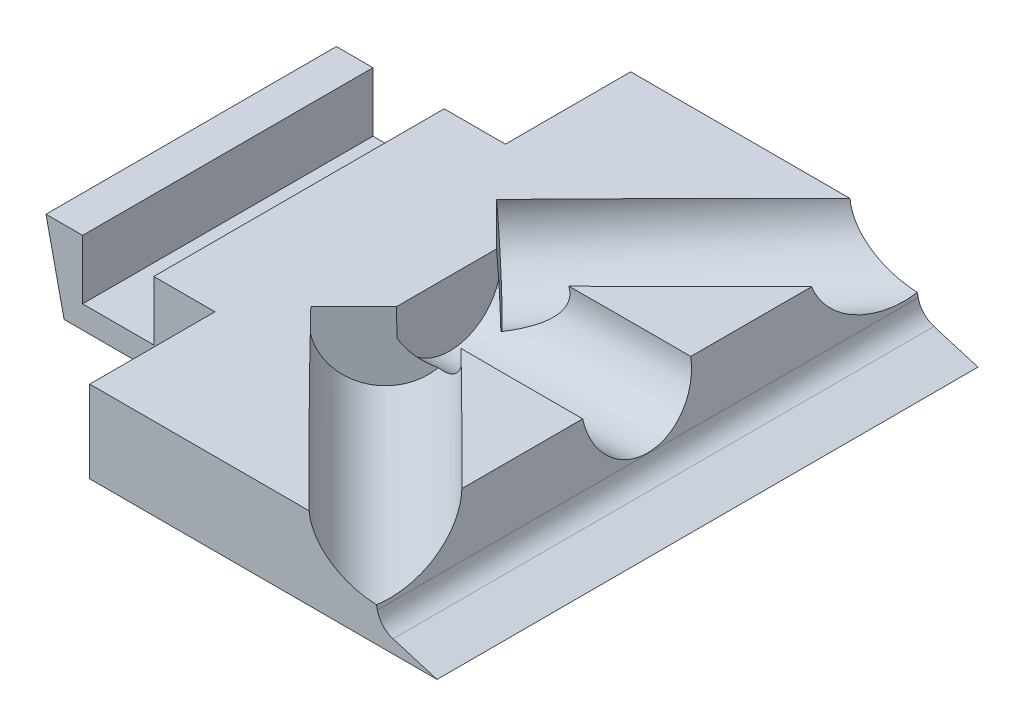
ISO-10303-21;
HEADER;
FILE_DESCRIPTION(('STEP AP214'),'2;1');
FILE_NAME('part.step','',(''),(''),'','','');
FILE_SCHEMA(('AUTOMOTIVE_DESIGN { 1 0 10303 214 1 1 1 1 }'));
ENDSEC;
DATA;
#1=APPLICATION_CONTEXT('core data for automotive mechanical design processes');
#2=APPLICATION_PROTOCOL_DEFINITION('international standard','automotive_design',2000,#1);
#3=PRODUCT_CONTEXT('',#1,'mechanical');
#4=PRODUCT('Part','Part','',(#3));
#5=PRODUCT_RELATED_PRODUCT_CATEGORY('part','',(#4));
#6=PRODUCT_DEFINITION_FORMATION('','',#4);
#7=PRODUCT_DEFINITION_CONTEXT('part definition',#1,'design');
#8=PRODUCT_DEFINITION('design','',#6,#7);
#9=PRODUCT_DEFINITION_SHAPE('','',#8);
#10=(LENGTH_UNIT() NAMED_UNIT(*) SI_UNIT(.MILLI.,.METRE.));
#11=(NAMED_UNIT(*) PLANE_ANGLE_UNIT() SI_UNIT($,.RADIAN.));
#12=(NAMED_UNIT(*) SI_UNIT($,.STERADIAN.) SOLID_ANGLE_UNIT());
#13=UNCERTAINTY_MEASURE_WITH_UNIT(LENGTH_MEASURE(1.E-05),#10,'distance_accuracy_value','');
#14=(GEOMETRIC_REPRESENTATION_CONTEXT(3) GLOBAL_UNCERTAINTY_ASSIGNED_CONTEXT((#13)) GLOBAL_UNIT_ASSIGNED_CONTEXT((#10,
#11,#12)) REPRESENTATION_CONTEXT('',''));
#15=CARTESIAN_POINT('',(0.,0.,0.));
#16=DIRECTION('',(0.,0.,1.));
#17=DIRECTION('',(1.,0.,0.));
#18=AXIS2_PLACEMENT_3D('',#15,#16,#17);
#19=CARTESIAN_POINT('',(29.0534494855228,3.,-54.5438018836308));
#20=DIRECTION('',(-0.978105928984835,-0.208107644464859,0.));
#21=DIRECTION('',(0.208107644464859,-0.978105928984836,0.));
#22=AXIS2_PLACEMENT_3D('',#19,#20,#21);
#23=PLANE('',#22);
#24=CARTESIAN_POINT('',(26.4460534707917,15.2547612692362,-45.9972058727721));
#25=DIRECTION('',(-0.978105928984835,-0.208107644464859,0.));
#26=DIRECTION('',(-0.0258354710819737,0.121426714085276,0.992264118841564));
#27=AXIS2_PLACEMENT_3D('',#24,#25,#26);
#28=ELLIPSE('',#27,13.5164397497986,9.49999999999975);
#29=CARTESIAN_POINT('',(26.6241432993672,14.4177390749316,-32.7461821799542));
#30=VERTEX_POINT('',#29);
#31=CARTESIAN_POINT('',(28.4070974389529,6.03785461887894,-49.5438018836307));
#32=VERTEX_POINT('',#31);
#33=EDGE_CURVE('E218',#30,#32,#28,.F.);
#34=ORIENTED_EDGE('',*,*,#33,.F.);
#35=DIRECTION('',(0.,0.,1.));
#36=VECTOR('',#35,1.);
#37=CARTESIAN_POINT('',(26.6241432993672,14.4177390749316,-54.5438018836308));
#38=LINE('',#37,#36);
#39=CARTESIAN_POINT('',(26.6241432993672,14.4177390749316,-11.5339275404717));
#40=VERTEX_POINT('',#39);
#41=EDGE_CURVE('E48',#30,#40,#38,.T.);
#42=ORIENTED_EDGE('',*,*,#41,.T.);
#43=CARTESIAN_POINT('',(26.5329230763294,14.8464741232089,-2.04380188363075));
#44=DIRECTION('',(-0.978105928984835,-0.208107644464859,0.));
#45=DIRECTION('',(-0.208107644464859,0.978105928984836,0.));
#46=AXIS2_PLACEMENT_3D('',#43,#44,#45);
#47=ELLIPSE('',#46,9.61631485144088,9.5);
#48=CARTESIAN_POINT('',(26.6241432993672,14.4177390749316,7.44632377321017));
#49=VERTEX_POINT('',#48);
#50=EDGE_CURVE('E223',#49,#40,#47,.F.);
#51=ORIENTED_EDGE('',*,*,#50,.F.);
#52=CARTESIAN_POINT('',(26.6241432993672,14.4177390749316,28.6585784126926));
#53=VERTEX_POINT('',#52);
#54=EDGE_CURVE('E359',#49,#53,#38,.T.);
#55=ORIENTED_EDGE('',*,*,#54,.T.);
#56=CARTESIAN_POINT('',(26.4460534707917,15.2547612692361,41.9096021055104));
#57=DIRECTION('',(-0.978105928984835,-0.208107644464859,0.));
#58=DIRECTION('',(-0.0258354710819744,0.12142671408528,-0.992264118841563));
#59=AXIS2_PLACEMENT_3D('',#56,#57,#58);
#60=ELLIPSE('',#59,13.5164397497986,9.49999999999983);
#61=CARTESIAN_POINT('',(28.4070974389529,6.03785461887886,45.4561981163693));
#62=VERTEX_POINT('',#61);
#63=EDGE_CURVE('E220',#62,#53,#60,.F.);
#64=ORIENTED_EDGE('',*,*,#63,.F.);
#65=DIRECTION('',(0.208107644464859,-0.978105928984835,0.));
#66=VECTOR('',#65,1.);
#67=CARTESIAN_POINT('',(29.0534494855228,3.,45.4561981163693));
#68=LINE('',#67,#66);
#69=CARTESIAN_POINT('',(28.5602756421312,5.31791706394046,45.4561981163693));
#70=VERTEX_POINT('',#69);
#71=EDGE_CURVE('E226',#62,#70,#68,.T.);
#72=ORIENTED_EDGE('',*,*,#71,.T.);
#73=DIRECTION('',(0.,0.,1.));
#74=VECTOR('',#73,1.);
#75=CARTESIAN_POINT('',(28.5602756421312,5.31791706394046,-49.5438018836307));
#76=LINE('',#75,#74);
#77=CARTESIAN_POINT('',(28.5602756421313,5.31791706394044,-49.5438018836307));
#78=VERTEX_POINT('',#77);
#79=EDGE_CURVE('E302',#70,#78,#76,.F.);
#80=ORIENTED_EDGE('',*,*,#79,.T.);
#81=DIRECTION('',(0.208107644464859,-0.978105928984836,0.));
#82=VECTOR('',#81,1.);
#83=CARTESIAN_POINT('',(15.8052901091694,65.266349068861,-49.5438018836307));
#84=LINE('',#83,#82);
#85=EDGE_CURVE('E232',#32,#78,#84,.T.);
#86=ORIENTED_EDGE('',*,*,#85,.F.);
#87=EDGE_LOOP('',(#34,#42,#51,#55,#64,#72,#80,#86));
#88=FACE_BOUND('',#87,.T.);
#89=ADVANCED_FACE('F33',(#88),#23,.F.);
#90=CARTESIAN_POINT('',(-55.9465505144772,50.,-49.5438018836307));
#91=DIRECTION('',(0.,0.,1.));
#92=DIRECTION('',(1.,0.,0.));
#93=AXIS2_PLACEMENT_3D('',#90,#91,#92);
#94=PLANE('',#93);
#95=DIRECTION('',(0.,-1.,0.));
#96=VECTOR('',#95,1.);
#97=CARTESIAN_POINT('',(-21.9465505144772,0.,-49.5438018836307));
#98=LINE('',#97,#96);
#99=CARTESIAN_POINT('',(-21.9465505144772,14.4177390749316,-49.5438018836307));
#100=VERTEX_POINT('',#99);
#101=CARTESIAN_POINT('',(-21.9465505144772,0.,-49.5438018836307));
#102=VERTEX_POINT('',#101);
#103=EDGE_CURVE('E337',#100,#102,#98,.T.);
#104=ORIENTED_EDGE('',*,*,#103,.F.);
#105=DIRECTION('',(1.,0.,0.));
#106=VECTOR('',#105,1.);
#107=CARTESIAN_POINT('',(-55.9465505144772,14.4177390749316,-49.5438018836307));
#108=LINE('',#107,#106);
#109=CARTESIAN_POINT('',(16.5816523108521,14.4177390749316,-49.5438018836307));
#110=VERTEX_POINT('',#109);
#111=EDGE_CURVE('E192',#100,#110,#108,.T.);
#112=ORIENTED_EDGE('',*,*,#111,.T.);
#113=CARTESIAN_POINT('',(29.9926494816504,15.555699919965,-49.5438018836307));
#114=DIRECTION('',(0.,0.,1.));
#115=DIRECTION('',(-0.996419324090102,-0.0845489833163317,0.));
#116=AXIS2_PLACEMENT_3D('',#113,#114,#115);
#117=ELLIPSE('',#116,13.4591901688025,9.49999999999975);
#118=EDGE_CURVE('E296',#32,#110,#117,.F.);
#119=ORIENTED_EDGE('',*,*,#118,.F.);
#120=ORIENTED_EDGE('',*,*,#85,.T.);
#121=CARTESIAN_POINT('',(32.4726993580706,6.1503476417999,-49.5438018836307));
#122=DIRECTION('',(0.,0.,1.));
#123=DIRECTION('',(1.,0.,0.));
#124=AXIS2_PLACEMENT_3D('',#121,#122,#123);
#125=CIRCLE('',#124,4.);
#126=CARTESIAN_POINT('',(31.3233078158052,2.31904250091529,-49.5438018836307));
#127=VERTEX_POINT('',#126);
#128=EDGE_CURVE('E306',#78,#127,#125,.T.);
#129=ORIENTED_EDGE('',*,*,#128,.T.);
#130=DIRECTION('',(0.957826285221151,-0.287347885566345,0.));
#131=VECTOR('',#130,1.);
#132=CARTESIAN_POINT('',(-61.8639817071377,30.2752293577982,-49.5438018836307));
#133=LINE('',#132,#131);
#134=CARTESIAN_POINT('',(39.0534494855228,0.,-49.5438018836307));
#135=VERTEX_POINT('',#134);
#136=EDGE_CURVE('E235',#127,#135,#133,.T.);
#137=ORIENTED_EDGE('',*,*,#136,.T.);
#138=DIRECTION('',(-1.,0.,0.));
#139=VECTOR('',#138,1.);
#140=CARTESIAN_POINT('',(-55.9465505144772,0.,-49.5438018836307));
#141=LINE('',#140,#139);
#142=EDGE_CURVE('E287',#135,#102,#141,.T.);
#143=ORIENTED_EDGE('',*,*,#142,.T.);
#144=EDGE_LOOP('',(#104,#112,#119,#120,#129,#137,#143));
#145=FACE_BOUND('',#144,.T.);
#146=ADVANCED_FACE('F439',(#145),#94,.F.);
#147=CARTESIAN_POINT('',(-55.9465505144772,50.,45.4561981163693));
#148=DIRECTION('',(0.,0.,-1.));
#149=DIRECTION('',(-1.,0.,0.));
#150=AXIS2_PLACEMENT_3D('',#147,#148,#149);
#151=PLANE('',#150);
#152=CARTESIAN_POINT('',(29.9926494816506,15.555699919965,45.4561981163693));
#153=DIRECTION('',(0.,0.,-1.));
#154=DIRECTION('',(-0.996419324090102,-0.0845489833163307,0.));
#155=AXIS2_PLACEMENT_3D('',#152,#153,#154);
#156=ELLIPSE('',#155,13.4591901688027,9.49999999999983);
#157=CARTESIAN_POINT('',(16.5816523108518,14.4177390749316,45.4561981163693));
#158=VERTEX_POINT('',#157);
#159=EDGE_CURVE('E201',#158,#62,#156,.F.);
#160=ORIENTED_EDGE('',*,*,#159,.F.);
#161=DIRECTION('',(1.,0.,0.));
#162=VECTOR('',#161,1.);
#163=CARTESIAN_POINT('',(16.5816523108521,14.4177390749316,45.4561981163693));
#164=LINE('',#163,#162);
#165=CARTESIAN_POINT('',(-21.9465505144772,14.4177390749316,45.4561981163693));
#166=VERTEX_POINT('',#165);
#167=EDGE_CURVE('E184',#166,#158,#164,.T.);
#168=ORIENTED_EDGE('',*,*,#167,.F.);
#169=DIRECTION('',(0.,1.,0.));
#170=VECTOR('',#169,1.);
#171=CARTESIAN_POINT('',(-21.9465505144772,0.,45.4561981163693));
#172=LINE('',#171,#170);
#173=CARTESIAN_POINT('',(-21.9465505144772,0.,45.4561981163693));
#174=VERTEX_POINT('',#173);
#175=EDGE_CURVE('E198',#174,#166,#172,.T.);
#176=ORIENTED_EDGE('',*,*,#175,.F.);
#177=DIRECTION('',(1.,0.,0.));
#178=VECTOR('',#177,1.);
#179=CARTESIAN_POINT('',(-55.9465505144772,0.,45.4561981163693));
#180=LINE('',#179,#178);
#181=CARTESIAN_POINT('',(39.0534494855228,0.,45.4561981163693));
#182=VERTEX_POINT('',#181);
#183=EDGE_CURVE('E282',#174,#182,#180,.T.);
#184=ORIENTED_EDGE('',*,*,#183,.T.);
#185=DIRECTION('',(0.957826285221151,-0.287347885566345,0.));
#186=VECTOR('',#185,1.);
#187=CARTESIAN_POINT('',(39.0534494855228,0.,45.4561981163693));
#188=LINE('',#187,#186);
#189=CARTESIAN_POINT('',(31.3233078158052,2.31904250091529,45.4561981163693));
#190=VERTEX_POINT('',#189);
#191=EDGE_CURVE('E229',#190,#182,#188,.T.);
#192=ORIENTED_EDGE('',*,*,#191,.F.);
#193=CARTESIAN_POINT('',(32.4726993580706,6.1503476417999,45.4561981163693));
#194=DIRECTION('',(0.,0.,-1.));
#195=DIRECTION('',(-1.,0.,0.));
#196=AXIS2_PLACEMENT_3D('',#193,#194,#195);
#197=CIRCLE('',#196,4.);
#198=EDGE_CURVE('E304',#190,#70,#197,.T.);
#199=ORIENTED_EDGE('',*,*,#198,.T.);
#200=ORIENTED_EDGE('',*,*,#71,.F.);
#201=EDGE_LOOP('',(#160,#168,#176,#184,#192,#199,#200));
#202=FACE_BOUND('',#201,.T.);
#203=ADVANCED_FACE('F197',(#202),#151,.F.);
#204=CARTESIAN_POINT('',(-6.71686597218381,13.0509855145892,-2.04380188363075));
#205=DIRECTION('',(0.998545180917308,0.0539214397695347,0.));
#206=DIRECTION('',(-0.0539214397695347,0.998545180917309,0.));
#207=AXIS2_PLACEMENT_3D('',#204,#205,#206);
#208=CYLINDRICAL_SURFACE('',#207,9.5);
#209=ORIENTED_EDGE('',*,*,#50,.T.);
#210=CARTESIAN_POINT('',(18.5933851452674,14.4177390749316,-2.04380188363075));
#211=DIRECTION('',(0.,-1.,0.));
#212=DIRECTION('',(1.,0.,0.));
#213=AXIS2_PLACEMENT_3D('',#210,#211,#212);
#214=ELLIPSE('',#213,176.182239209559,9.5);
#215=CARTESIAN_POINT('',(5.22643161729281,14.4177390749316,-11.5164201736081));
#216=VERTEX_POINT('',#215);
#217=EDGE_CURVE('E365',#40,#216,#214,.F.);
#218=ORIENTED_EDGE('',*,*,#217,.T.);
#219=CARTESIAN_POINT('',(-4.56689805842484,20.5014142819925,-8.0947521144356));
#220=CARTESIAN_POINT('',(-4.33225599602943,20.4488003755294,-8.17364472122514));
#221=CARTESIAN_POINT('',(-4.09831991987234,20.3936533999042,-8.25297274054923));
#222=CARTESIAN_POINT('',(-3.6319723273335,20.2779532455273,-8.41225867708304));
#223=CARTESIAN_POINT('',(-3.39956099855203,20.2173994144437,-8.49221666923444));
#224=CARTESIAN_POINT('',(-2.935850455229,20.0903986941744,-8.65270379654423));
#225=CARTESIAN_POINT('',(-2.70455550191642,20.0239373811584,-8.73323386194536));
#226=CARTESIAN_POINT('',(-2.24388052249788,19.8848391065148,-8.89442045986951));
#227=CARTESIAN_POINT('',(-2.01450042627539,19.8122023721123,-8.97507698763224));
#228=CARTESIAN_POINT('',(-1.55665311912561,19.6598445083659,-9.13671461530698));
#229=CARTESIAN_POINT('',(-1.32819788787797,19.5800865754283,-9.21769505721916));
#230=CARTESIAN_POINT('',(-0.873840453641928,19.4132426691012,-9.37926210189281));
#231=CARTESIAN_POINT('',(-0.647938153388363,19.3261569759698,-9.45984871959191));
#232=CARTESIAN_POINT('',(-0.199351831332736,19.144036344205,-9.6202507628795));
#233=CARTESIAN_POINT('',(0.023335063029552,19.0490090914755,-9.70006685259626));
#234=CARTESIAN_POINT('',(0.465080976334485,18.850102721621,-9.85864143280677));
#235=CARTESIAN_POINT('',(0.684140511012849,18.746224876001,-9.93740007334148));
#236=CARTESIAN_POINT('',(1.0882753148595,18.5434306951372,-10.0827938815438));
#237=CARTESIAN_POINT('',(1.27391125425415,18.4457695180671,-10.1496176838629));
#238=CARTESIAN_POINT('',(1.64121856569114,18.2422888667174,-10.2818141032291));
#239=CARTESIAN_POINT('',(1.8228897567433,18.1364690209913,-10.3471866540291));
#240=CARTESIAN_POINT('',(2.18180318740148,17.9154812272708,-10.4761990874294));
#241=CARTESIAN_POINT('',(2.35903321530376,17.8002905639837,-10.5398342282835));
#242=CARTESIAN_POINT('',(2.70736810734731,17.5597145325413,-10.6646267749547));
#243=CARTESIAN_POINT('',(2.87847325864263,17.4343296432282,-10.7257842969483));
#244=CARTESIAN_POINT('',(3.21560789538356,17.1700108716297,-10.8458280804137));
#245=CARTESIAN_POINT('',(3.3815120071856,17.0308919788594,-10.9046622011023));
#246=CARTESIAN_POINT('',(3.70301721095151,16.7393269509347,-11.0179659926317));
#247=CARTESIAN_POINT('',(3.85861388019386,16.5868751591608,-11.0724337920489));
#248=CARTESIAN_POINT('',(4.15532843354882,16.2681178542739,-11.175255156819));
#249=CARTESIAN_POINT('',(4.29652253014544,16.1018947160832,-11.2236412584394));
#250=CARTESIAN_POINT('',(4.56092453322871,15.7538739756097,-11.312729991647));
#251=CARTESIAN_POINT('',(4.6841501476811,15.5720919909097,-11.3534401995967));
#252=CARTESIAN_POINT('',(4.90699547178048,15.1928383248048,-11.4248090153655));
#253=CARTESIAN_POINT('',(5.00664714506123,14.9953883784836,-11.4554812554512));
#254=CARTESIAN_POINT('',(5.17599854601488,14.5865103891999,-11.504156845132));
#255=CARTESIAN_POINT('',(5.24572689940183,14.3750959296611,-11.5221723132073));
#256=CARTESIAN_POINT('',(5.34995577599859,13.9412413877521,-11.543365030161));
#257=CARTESIAN_POINT('',(5.38420212979633,13.71873356199,-11.5464357958064));
#258=CARTESIAN_POINT('',(5.41393294135975,13.2714775021975,-11.5365326069259));
#259=CARTESIAN_POINT('',(5.4094138866725,13.0467290669929,-11.5235571985806));
#260=CARTESIAN_POINT('',(5.3655597958662,12.6205480738891,-11.4842653281633));
#261=CARTESIAN_POINT('',(5.32906057848457,12.4186964095706,-11.4591085752597));
#262=CARTESIAN_POINT('',(5.22927541660934,12.0235933932393,-11.3979350687655));
#263=CARTESIAN_POINT('',(5.16597845962318,11.830345613103,-11.3619138521912));
#264=CARTESIAN_POINT('',(4.97172264577934,11.3387911087939,-11.2561248609913));
#265=CARTESIAN_POINT('',(4.82309423269255,11.0489905434561,-11.1792291698687));
#266=CARTESIAN_POINT('',(4.5709731233482,10.6363754584025,-11.0521685963663));
#267=CARTESIAN_POINT('',(4.48187362643259,10.5022858197283,-11.0077672229066));
#268=CARTESIAN_POINT('',(4.29553006882358,10.2410530940272,-10.9156780870717));
#269=CARTESIAN_POINT('',(4.19828744896855,10.1139087846493,-10.8679909063485));
#270=CARTESIAN_POINT('',(3.91295820390433,9.76255830121186,-10.7288676210697));
#271=CARTESIAN_POINT('',(3.71691217857024,9.54610723217295,-10.6341976878373));
#272=CARTESIAN_POINT('',(3.30856784086871,9.13237785709488,-10.4381006952109));
#273=CARTESIAN_POINT('',(3.09625481624534,8.93511728218306,-10.3366675300084));
#274=CARTESIAN_POINT('',(2.65870269186332,8.55646590935589,-10.1281800605755));
#275=CARTESIAN_POINT('',(2.43340888811384,8.37515186222596,-10.021102157976));
#276=CARTESIAN_POINT('',(1.97367945489025,8.02718286624318,-9.80277028206226));
#277=CARTESIAN_POINT('',(1.73924105454741,7.86053241113764,-9.69151504337773));
#278=CARTESIAN_POINT('',(1.16336505936575,7.47279453375139,-9.41805676499994));
#279=CARTESIAN_POINT('',(0.818360817173119,7.25825792323411,-9.25408961908723));
#280=CARTESIAN_POINT('',(0.118215035644663,6.8511184717841,-8.92028491578519));
#281=CARTESIAN_POINT('',(-0.236932595157035,6.658529172737,-8.7504438173944));
#282=CARTESIAN_POINT('',(-0.946922814297158,6.29630927652942,-8.40912523956741));
#283=CARTESIAN_POINT('',(-1.30161631569162,6.12628262905609,-8.23775634720461));
#284=CARTESIAN_POINT('',(-1.83709095063916,5.88358396276574,-7.97715602075883));
#285=CARTESIAN_POINT('',(-2.01602683832496,5.8047927816907,-7.88976128493358));
#286=CARTESIAN_POINT('',(-2.37492982051103,5.65107606405432,-7.71372460314205));
#287=CARTESIAN_POINT('',(-2.55489685977932,5.57615032255826,-7.6250827236136));
#288=CARTESIAN_POINT('',(-2.73529182406675,5.50305391920793,-7.53579895838253));
#289=B_SPLINE_CURVE_WITH_KNOTS('',3,(#219,#220,#221,#222,#223,#224,#225,#226,#227,#228,#229,
#230,#231,#232,#233,#234,#235,#236,#237,#238,#239,#240,#241,#242,#243,#244,#245,#246,#247,#248,
#249,#250,#251,#252,#253,#254,#255,#256,#257,#258,#259,#260,#261,#262,#263,#264,#265,#266,#267,
#268,#269,#270,#271,#272,#273,#274,#275,#276,#277,#278,#279,#280,#281,#282,#283,#284,#285,#286,
#287,#288),.UNSPECIFIED.,.F.,.F.,(4,2,2,2,2,2,2,2,2,2,2,2,2,2,2,2,2,2,2,2,2,2,2,2,2,2,2,2,2,2,2,
2,2,2,4),(0.,0.759235565759512,1.51856285664431,2.27979792708037,3.04100499993291,
3.80640315451802,4.57177204890092,5.33640860609208,6.10093549774817,6.76120496214763,
7.42150450496608,8.08345527666092,8.74537497320384,9.41790796150104,10.0907276759899,
10.7597790295933,11.4281665100883,12.0956424697516,12.7624784669635,13.434058883109,
14.1057001504001,14.7232015907741,15.3409570391736,16.338754396032,16.8395483653825,
17.340253911079,18.2597146907051,19.1800170979018,20.1045308137893,21.0293268728913,
22.3427231125527,23.6569254030598,24.9436310287062,25.5860736801143,26.2284822359456),.UNSPECIFIED.);
#290=CARTESIAN_POINT('',(-2.73529182406738,5.50305391920772,-7.53579895838272));
#291=VERTEX_POINT('',#290);
#292=EDGE_CURVE('E271',#216,#291,#289,.T.);
#293=ORIENTED_EDGE('',*,*,#292,.T.);
#294=CARTESIAN_POINT('',(2.07595286425553,13.525797731757,-2.04380188363075));
#295=DIRECTION('',(0.705837415242118,0.0598922907279468,-0.705837415242125));
#296=DIRECTION('',(0.706320591921486,0.0163066443508857,0.707704256577347));
#297=AXIS2_PLACEMENT_3D('',#294,#295,#296);
#298=ELLIPSE('',#297,13.4173205237939,9.5);
#299=CARTESIAN_POINT('',(-6.5425041256802,9.82206243118891,-10.9765312351766));
#300=VERTEX_POINT('',#299);
#301=EDGE_CURVE('E276',#300,#291,#298,.F.);
#302=ORIENTED_EDGE('',*,*,#301,.F.);
#303=CARTESIAN_POINT('',(-6.71686597218381,13.0509855145892,-2.04380188363075));
#304=DIRECTION('',(0.998545180917308,0.0539214397695347,0.));
#305=DIRECTION('',(-0.0539214397695347,0.998545180917309,0.));
#306=AXIS2_PLACEMENT_3D('',#303,#304,#305);
#307=CIRCLE('',#306,9.5);
#308=CARTESIAN_POINT('',(-6.54250412568018,9.82206243118863,6.88892746791498));
#309=VERTEX_POINT('',#308);
#310=EDGE_CURVE('E280',#309,#300,#307,.T.);
#311=ORIENTED_EDGE('',*,*,#310,.F.);
#312=CARTESIAN_POINT('',(2.07595286425523,13.5257977317569,-2.04380188363075));
#313=DIRECTION('',(0.705837415242126,0.0598922907279467,0.705837415242118));
#314=DIRECTION('',(0.706320591921478,0.0163066443508853,-0.707704256577355));
#315=AXIS2_PLACEMENT_3D('',#312,#313,#314);
#316=ELLIPSE('',#315,13.4173205237938,9.5);
#317=CARTESIAN_POINT('',(-2.73529182406759,5.50305391920782,3.44819519112124));
#318=VERTEX_POINT('',#317);
#319=EDGE_CURVE('E247',#318,#309,#316,.F.);
#320=ORIENTED_EDGE('',*,*,#319,.F.);
#321=CARTESIAN_POINT('',(-2.7352918240672,5.50305391920813,3.44819519112081));
#322=CARTESIAN_POINT('',(-2.5284890396485,5.58685697103673,3.5505474548381));
#323=CARTESIAN_POINT('',(-2.3222355963858,5.67306030095207,3.65206497166396));
#324=CARTESIAN_POINT('',(-1.91110718577176,5.85059238639249,3.85347303838734));
#325=CARTESIAN_POINT('',(-1.70623240708124,5.94192182803639,3.95336336816974));
#326=CARTESIAN_POINT('',(-1.29763031305163,6.13026980249333,4.15180725024607));
#327=CARTESIAN_POINT('',(-1.09390776310995,6.22730342723031,4.25035632084846));
#328=CARTESIAN_POINT('',(-0.688557696195556,6.42721184050974,4.44581016289113));
#329=CARTESIAN_POINT('',(-0.486930093797941,6.53008638976437,4.54271500148048));
#330=CARTESIAN_POINT('',(-0.0847881839953783,6.74287105630762,4.73549621581496));
#331=CARTESIAN_POINT('',(0.115708565043817,6.85282521869078,4.83136071335836));
#332=CARTESIAN_POINT('',(0.513627162757627,7.07965853107784,5.02125567522945));
#333=CARTESIAN_POINT('',(0.711049141472897,7.19653738720717,5.11528621716293));
#334=CARTESIAN_POINT('',(1.10197559395353,7.43774076208653,5.301251481034));
#335=CARTESIAN_POINT('',(1.29548399963161,7.56205725451272,5.39318831952808));
#336=CARTESIAN_POINT('',(1.67796518608724,7.8189913108621,5.57481606934673));
#337=CARTESIAN_POINT('',(1.86693869036715,7.95160753829248,5.66450733903164));
#338=CARTESIAN_POINT('',(2.20745427281438,8.20256786234128,5.82618031272111));
#339=CARTESIAN_POINT('',(2.35986663423278,8.31946927462305,5.89856544179133));
#340=CARTESIAN_POINT('',(2.66012156386082,8.56021596723413,6.04130759747589));
#341=CARTESIAN_POINT('',(2.80796392173639,8.68406156643315,6.11166453073266));
#342=CARTESIAN_POINT('',(3.09835826000453,8.93960229109413,6.25012111359561));
#343=CARTESIAN_POINT('',(3.2409005475566,9.07131075085102,6.318216605284));
#344=CARTESIAN_POINT('',(3.51915176008551,9.34313632387322,6.45155056223067));
#345=CARTESIAN_POINT('',(3.65486093357087,9.48325313093473,6.516789131379));
#346=CARTESIAN_POINT('',(3.91977000202753,9.77491405274352,6.64473796275492));
#347=CARTESIAN_POINT('',(4.04884565410897,9.92659533462317,6.70739728705121));
#348=CARTESIAN_POINT('',(4.29597800501789,10.2402898625221,6.82824748125247));
#349=CARTESIAN_POINT('',(4.41403093095531,10.4023066144884,6.88643681995864));
#350=CARTESIAN_POINT('',(4.7463903980432,10.9039127852696,7.05214090146896));
#351=CARTESIAN_POINT('',(4.94067101181784,11.2609089942035,7.15164171155111));
#352=CARTESIAN_POINT('',(5.17078091057172,11.8421317495828,7.27690912252399));
#353=CARTESIAN_POINT('',(5.23830109718238,12.0510792622815,7.3154639919302));
#354=CARTESIAN_POINT('',(5.3416578257548,12.4786785073256,7.37971805671404));
#355=CARTESIAN_POINT('',(5.37752719413414,12.6973199378516,7.40543055941598));
#356=CARTESIAN_POINT('',(5.41279066674086,13.1404562507173,7.44198829889074));
#357=CARTESIAN_POINT('',(5.41193054665659,13.3649811764726,7.45272938262297));
#358=CARTESIAN_POINT('',(5.37165861093977,13.8107714853821,7.45823060667445));
#359=CARTESIAN_POINT('',(5.33224104227713,14.0320363771165,7.45298836192672));
#360=CARTESIAN_POINT('',(5.22262018502946,14.4469965972219,7.42868963074717));
#361=CARTESIAN_POINT('',(5.15510100921995,14.6414877960957,7.41075957375059));
#362=CARTESIAN_POINT('',(4.99485974943007,15.018267243802,7.36422678667008));
#363=CARTESIAN_POINT('',(4.90212785115159,15.2005507061451,7.33561989890603));
#364=CARTESIAN_POINT('',(4.63169114317075,15.6622771543008,7.24907779602607));
#365=CARTESIAN_POINT('',(4.4372549121772,15.9305980440984,7.18401901245872));
#366=CARTESIAN_POINT('',(4.11936110556804,16.3069410784372,7.07519806911159));
#367=CARTESIAN_POINT('',(4.00878729010553,16.4282384797407,7.03696863458578));
#368=CARTESIAN_POINT('',(3.78040187587814,16.6627627907887,6.95742701935154));
#369=CARTESIAN_POINT('',(3.6625916221266,16.7759911918916,6.91611541121222));
#370=CARTESIAN_POINT('',(3.31917347868404,17.087419109953,6.79508959636809));
#371=CARTESIAN_POINT('',(3.08651224274498,17.2766689869357,6.71239387906013));
#372=CARTESIAN_POINT('',(2.607150474039,17.6336336212181,6.54122849014518));
#373=CARTESIAN_POINT('',(2.36043720803621,17.801328383506,6.4527535707085));
#374=CARTESIAN_POINT('',(1.85561772598296,18.119053854895,6.27138163992721));
#375=CARTESIAN_POINT('',(1.59745980077808,18.2689900672961,6.17846436837508));
#376=CARTESIAN_POINT('',(1.07360789387455,18.5527683466452,5.98991773858171));
#377=CARTESIAN_POINT('',(0.80791664029042,18.6866161501171,5.8942893621396));
#378=CARTESIAN_POINT('',(0.333484370093445,18.9106789829904,5.72377565958062));
#379=CARTESIAN_POINT('',(0.125956301414573,19.0037776166849,5.6492695208411));
#380=CARTESIAN_POINT('',(-0.292009575162518,19.1825415844987,5.4994889075905));
#381=CARTESIAN_POINT('',(-0.502447589724232,19.2682063874935,5.42421437860899));
#382=CARTESIAN_POINT('',(-1.13771541662509,19.5151487420168,5.19755551081745));
#383=CARTESIAN_POINT('',(-1.5662620281544,19.6662643995045,5.04542132505742));
#384=CARTESIAN_POINT('',(-2.20957714194902,19.8739760297287,4.81889076944873));
#385=CARTESIAN_POINT('',(-2.4215960450027,19.9393886465901,4.74452621582118));
#386=CARTESIAN_POINT('',(-2.84722869456327,20.0650462834311,4.59594933018217));
#387=CARTESIAN_POINT('',(-3.06084247655929,20.1252911880445,4.52173700160513));
#388=CARTESIAN_POINT('',(-3.48911661576973,20.2408267523935,4.37379168444273));
#389=CARTESIAN_POINT('',(-3.70377447327178,20.2961259345674,4.30005808257861));
#390=CARTESIAN_POINT('',(-4.1343860358446,20.4021413520917,4.15314214013571));
#391=CARTESIAN_POINT('',(-4.35033962957167,20.4528579753771,4.07995975337569));
#392=CARTESIAN_POINT('',(-4.56689805842534,20.5014142819928,4.00714834717474));
#393=B_SPLINE_CURVE_WITH_KNOTS('',3,(#321,#322,#323,#324,#325,#326,#327,#328,#329,#330,#331,
#332,#333,#334,#335,#336,#337,#338,#339,#340,#341,#342,#343,#344,#345,#346,#347,#348,#349,#350,
#351,#352,#353,#354,#355,#356,#357,#358,#359,#360,#361,#362,#363,#364,#365,#366,#367,#368,#369,
#370,#371,#372,#373,#374,#375,#376,#377,#378,#379,#380,#381,#382,#383,#384,#385,#386,#387,#388,
#389,#390,#391,#392),.UNSPECIFIED.,.F.,.F.,(4,2,2,2,2,2,2,2,2,2,2,2,2,2,2,2,2,2,2,2,2,2,2,2,2,2,
2,2,2,2,2,2,2,2,2,4),(0.,0.736474954782578,1.47304872129461,2.21166761566259,2.95025627249742,
3.69399354147617,4.43769926983485,5.18061641913616,5.92341424398032,6.53906498553613,
7.15474402030964,7.77149857583298,8.3882306848381,9.01398354687215,9.63994981417915,
10.8838580104374,11.550440569303,12.2163309715297,12.8868310973119,13.5574312814754,
14.1749447147176,14.7926988660801,15.7995648840619,16.3049281886689,16.8101978456077,
17.7419560001177,18.6745723310167,19.611947329555,20.5489870975344,21.2668831880064,
21.9848305278057,23.4215482412065,24.1235416579923,24.8255507423223,25.5263258328982,
26.2270415439241),.UNSPECIFIED.);
#394=CARTESIAN_POINT('',(5.22643161729321,14.4177390749314,7.42881640634733));
#395=VERTEX_POINT('',#394);
#396=EDGE_CURVE('E239',#318,#395,#393,.T.);
#397=ORIENTED_EDGE('',*,*,#396,.T.);
#398=EDGE_CURVE('E56',#395,#49,#214,.F.);
#399=ORIENTED_EDGE('',*,*,#398,.T.);
#400=EDGE_LOOP('',(#209,#218,#293,#302,#311,#320,#397,#399));
#401=FACE_BOUND('',#400,.T.);
#402=ADVANCED_FACE('F249',(#401),#208,.F.);
#403=CARTESIAN_POINT('',(-7.66624825135373,12.3602364848829,-11.8849041506263));
#404=DIRECTION('',(0.705837415242118,0.0598922907279468,-0.705837415242125));
#405=DIRECTION('',(-0.707106781186551,0.,-0.707106781186544));
#406=AXIS2_PLACEMENT_3D('',#403,#404,#405);
#407=CYLINDRICAL_SURFACE('',#406,9.50000000000001);
#408=ORIENTED_EDGE('',*,*,#118,.T.);
#409=CARTESIAN_POINT('',(16.5816523108519,14.4177390749316,-36.1328047128321));
#410=DIRECTION('',(0.,-1.,0.));
#411=DIRECTION('',(0.707106781186544,0.,-0.707106781186551));
#412=AXIS2_PLACEMENT_3D('',#409,#410,#411);
#413=ELLIPSE('',#412,158.618077293997,9.50000000000001);
#414=CARTESIAN_POINT('',(-14.3110342370678,14.4177390749316,-18.3551052522924));
#415=VERTEX_POINT('',#414);
#416=EDGE_CURVE('E374',#110,#415,#413,.F.);
#417=ORIENTED_EDGE('',*,*,#416,.T.);
#418=CARTESIAN_POINT('',(-7.66624825135373,12.3602364848829,-11.8849041506263));
#419=DIRECTION('',(0.705837415242118,0.0598922907279468,-0.705837415242125));
#420=DIRECTION('',(-0.707106781186551,0.,-0.707106781186544));
#421=AXIS2_PLACEMENT_3D('',#418,#419,#420);
#422=CIRCLE('',#421,9.50000000000001);
#423=EDGE_CURVE('E277',#291,#415,#422,.T.);
#424=ORIENTED_EDGE('',*,*,#423,.F.);
#425=ORIENTED_EDGE('',*,*,#292,.F.);
#426=EDGE_CURVE('E362',#216,#30,#413,.F.);
#427=ORIENTED_EDGE('',*,*,#426,.T.);
#428=ORIENTED_EDGE('',*,*,#33,.T.);
#429=EDGE_LOOP('',(#408,#417,#424,#425,#427,#428));
#430=FACE_BOUND('',#429,.T.);
#431=ADVANCED_FACE('F259',(#430),#407,.F.);
#432=CARTESIAN_POINT('',(-7.66624825135406,12.3602364848828,7.79730038336499));
#433=DIRECTION('',(0.705837415242126,0.0598922907279467,0.705837415242118));
#434=DIRECTION('',(0.707106781186544,0.,-0.707106781186551));
#435=AXIS2_PLACEMENT_3D('',#432,#433,#434);
#436=CYLINDRICAL_SURFACE('',#435,9.5);
#437=ORIENTED_EDGE('',*,*,#63,.T.);
#438=CARTESIAN_POINT('',(16.5816523108521,14.4177390749316,32.0452009455709));
#439=DIRECTION('',(0.,-1.,0.));
#440=DIRECTION('',(0.707106781186551,0.,0.707106781186544));
#441=AXIS2_PLACEMENT_3D('',#438,#439,#440);
#442=ELLIPSE('',#441,158.618077293997,9.5);
#443=EDGE_CURVE('E364',#53,#395,#442,.F.);
#444=ORIENTED_EDGE('',*,*,#443,.T.);
#445=ORIENTED_EDGE('',*,*,#396,.F.);
#446=CARTESIAN_POINT('',(-7.66624825135406,12.3602364848828,7.79730038336499));
#447=DIRECTION('',(0.705837415242126,0.0598922907279467,0.705837415242118));
#448=DIRECTION('',(0.707106781186544,0.,-0.707106781186551));
#449=AXIS2_PLACEMENT_3D('',#446,#447,#448);
#450=CIRCLE('',#449,9.5);
#451=CARTESIAN_POINT('',(-14.311034237068,14.4177390749316,14.2675014850311));
#452=VERTEX_POINT('',#451);
#453=EDGE_CURVE('E237',#452,#318,#450,.T.);
#454=ORIENTED_EDGE('',*,*,#453,.F.);
#455=EDGE_CURVE('E366',#452,#158,#442,.F.);
#456=ORIENTED_EDGE('',*,*,#455,.T.);
#457=ORIENTED_EDGE('',*,*,#159,.T.);
#458=EDGE_LOOP('',(#437,#444,#445,#454,#456,#457));
#459=FACE_BOUND('',#458,.T.);
#460=ADVANCED_FACE('F253',(#459),#436,.F.);
#461=CARTESIAN_POINT('',(-6.71686597218381,13.0509855145892,-2.04380188363075));
#462=DIRECTION('',(0.998545180917308,0.0539214397695347,0.));
#463=DIRECTION('',(-0.0539214397695347,0.998545180917309,0.));
#464=AXIS2_PLACEMENT_3D('',#461,#462,#463);
#465=PLANE('',#464);
#466=DIRECTION('',(0.,0.,-1.));
#467=VECTOR('',#466,1.);
#468=CARTESIAN_POINT('',(-6.7906706644423,14.4177390749316,-2.04380188363075));
#469=LINE('',#468,#467);
#470=CARTESIAN_POINT('',(-6.7906706644423,14.4177390749316,6.74713791240535));
#471=VERTEX_POINT('',#470);
#472=CARTESIAN_POINT('',(-6.7906706644423,14.4177390749316,-10.834741679667));
#473=VERTEX_POINT('',#472);
#474=EDGE_CURVE('E370',#471,#473,#469,.T.);
#475=ORIENTED_EDGE('',*,*,#474,.F.);
#476=DIRECTION('',(0.0538958687842377,-0.998071644152549,0.030793318538595));
#477=VECTOR('',#476,1.);
#478=CARTESIAN_POINT('',(-6.73152568665103,13.3224617084265,6.78093030099038));
#479=LINE('',#478,#477);
#480=EDGE_CURVE('E293',#471,#309,#479,.T.);
#481=ORIENTED_EDGE('',*,*,#480,.T.);
#482=ORIENTED_EDGE('',*,*,#310,.T.);
#483=DIRECTION('',(-0.0538958687842377,0.998071644152549,0.0307933185385954));
#484=VECTOR('',#483,1.);
#485=CARTESIAN_POINT('',(-6.73152568665103,13.3224617084266,-10.868534068252));
#486=LINE('',#485,#484);
#487=EDGE_CURVE('E290',#300,#473,#486,.T.);
#488=ORIENTED_EDGE('',*,*,#487,.T.);
#489=EDGE_LOOP('',(#475,#481,#482,#488));
#490=FACE_BOUND('',#489,.T.);
#491=ADVANCED_FACE('F258',(#490),#465,.T.);
#492=CARTESIAN_POINT('',(-7.66624825135373,12.3602364848829,-11.8849041506263));
#493=DIRECTION('',(0.705837415242118,0.0598922907279468,-0.705837415242125));
#494=DIRECTION('',(-0.707106781186551,0.,-0.707106781186544));
#495=AXIS2_PLACEMENT_3D('',#492,#493,#494);
#496=PLANE('',#495);
#497=DIRECTION('',(-0.707106781186551,0.,-0.707106781186544));
#498=VECTOR('',#497,1.);
#499=CARTESIAN_POINT('',(-7.75354069337767,14.4177390749316,-11.7976117086023));
#500=LINE('',#499,#498);
#501=EDGE_CURVE('E372',#473,#415,#500,.T.);
#502=ORIENTED_EDGE('',*,*,#501,.F.);
#503=ORIENTED_EDGE('',*,*,#487,.F.);
#504=ORIENTED_EDGE('',*,*,#301,.T.);
#505=ORIENTED_EDGE('',*,*,#423,.T.);
#506=EDGE_LOOP('',(#502,#503,#504,#505));
#507=FACE_BOUND('',#506,.T.);
#508=ADVANCED_FACE('F263',(#507),#496,.T.);
#509=CARTESIAN_POINT('',(-7.66624825135406,12.3602364848828,7.79730038336499));
#510=DIRECTION('',(0.705837415242126,0.0598922907279467,0.705837415242118));
#511=DIRECTION('',(0.707106781186544,0.,-0.707106781186551));
#512=AXIS2_PLACEMENT_3D('',#509,#510,#511);
#513=PLANE('',#512);
#514=DIRECTION('',(0.707106781186544,0.,-0.707106781186551));
#515=VECTOR('',#514,1.);
#516=CARTESIAN_POINT('',(-7.753540693378,14.4177390749316,7.71000794134105));
#517=LINE('',#516,#515);
#518=EDGE_CURVE('E368',#452,#471,#517,.T.);
#519=ORIENTED_EDGE('',*,*,#518,.F.);
#520=ORIENTED_EDGE('',*,*,#453,.T.);
#521=ORIENTED_EDGE('',*,*,#319,.T.);
#522=ORIENTED_EDGE('',*,*,#480,.F.);
#523=EDGE_LOOP('',(#519,#520,#521,#522));
#524=FACE_BOUND('',#523,.T.);
#525=ADVANCED_FACE('F261',(#524),#513,.T.);
#526=CARTESIAN_POINT('',(0.,0.,0.));
#527=DIRECTION('',(0.,1.,0.));
#528=DIRECTION('',(0.,0.,1.));
#529=AXIS2_PLACEMENT_3D('',#526,#527,#528);
#530=PLANE('',#529);
#531=DIRECTION('',(1.,0.,0.));
#532=VECTOR('',#531,1.);
#533=CARTESIAN_POINT('',(-55.9465505144772,0.,23.4561981163693));
#534=LINE('',#533,#532);
#535=CARTESIAN_POINT('',(-48.4465505144772,0.,23.4561981163693));
#536=VERTEX_POINT('',#535);
#537=CARTESIAN_POINT('',(-21.9465505144772,0.,23.4561981163693));
#538=VERTEX_POINT('',#537);
#539=EDGE_CURVE('E207',#536,#538,#534,.T.);
#540=ORIENTED_EDGE('',*,*,#539,.F.);
#541=DIRECTION('',(0.,0.,1.));
#542=VECTOR('',#541,1.);
#543=CARTESIAN_POINT('',(-48.4465505144772,0.,-36.5438018836307));
#544=LINE('',#543,#542);
#545=CARTESIAN_POINT('',(-48.4465505144772,0.,-27.5438018836308));
#546=VERTEX_POINT('',#545);
#547=EDGE_CURVE('E319',#546,#536,#544,.T.);
#548=ORIENTED_EDGE('',*,*,#547,.F.);
#549=DIRECTION('',(-1.,0.,0.));
#550=VECTOR('',#549,1.);
#551=CARTESIAN_POINT('',(-55.9465505144772,0.,-27.5438018836308));
#552=LINE('',#551,#550);
#553=CARTESIAN_POINT('',(-21.9465505144772,0.,-27.5438018836308));
#554=VERTEX_POINT('',#553);
#555=EDGE_CURVE('E213',#554,#546,#552,.T.);
#556=ORIENTED_EDGE('',*,*,#555,.F.);
#557=DIRECTION('',(0.,0.,-1.));
#558=VECTOR('',#557,1.);
#559=CARTESIAN_POINT('',(-21.9465505144772,0.,-27.5438018836308));
#560=LINE('',#559,#558);
#561=EDGE_CURVE('E208',#554,#102,#560,.T.);
#562=ORIENTED_EDGE('',*,*,#561,.T.);
#563=ORIENTED_EDGE('',*,*,#142,.F.);
#564=DIRECTION('',(0.,0.,-1.));
#565=VECTOR('',#564,1.);
#566=CARTESIAN_POINT('',(39.0534494855228,0.,-49.5438018836307));
#567=LINE('',#566,#565);
#568=EDGE_CURVE('E284',#182,#135,#567,.T.);
#569=ORIENTED_EDGE('',*,*,#568,.F.);
#570=ORIENTED_EDGE('',*,*,#183,.F.);
#571=DIRECTION('',(0.,0.,1.));
#572=VECTOR('',#571,1.);
#573=CARTESIAN_POINT('',(-21.9465505144772,0.,23.4561981163693));
#574=LINE('',#573,#572);
#575=EDGE_CURVE('E206',#538,#174,#574,.T.);
#576=ORIENTED_EDGE('',*,*,#575,.F.);
#577=EDGE_LOOP('',(#540,#548,#556,#562,#563,#569,#570,#576));
#578=FACE_BOUND('',#577,.T.);
#579=ADVANCED_FACE('F327',(#578),#530,.F.);
#580=CARTESIAN_POINT('',(39.0534494855228,0.,-54.5438018836308));
#581=DIRECTION('',(-0.287347885566345,-0.957826285221151,0.));
#582=DIRECTION('',(0.957826285221151,-0.287347885566345,0.));
#583=AXIS2_PLACEMENT_3D('',#580,#581,#582);
#584=PLANE('',#583);
#585=ORIENTED_EDGE('',*,*,#136,.F.);
#586=DIRECTION('',(0.,0.,1.));
#587=VECTOR('',#586,1.);
#588=CARTESIAN_POINT('',(31.3233078158052,2.31904250091529,45.4561981163692));
#589=LINE('',#588,#587);
#590=EDGE_CURVE('E299',#127,#190,#589,.T.);
#591=ORIENTED_EDGE('',*,*,#590,.T.);
#592=ORIENTED_EDGE('',*,*,#191,.T.);
#593=ORIENTED_EDGE('',*,*,#568,.T.);
#594=EDGE_LOOP('',(#585,#591,#592,#593));
#595=FACE_BOUND('',#594,.T.);
#596=ADVANCED_FACE('F411',(#595),#584,.F.);
#597=CARTESIAN_POINT('',(32.4726993580706,6.1503476417999,-54.5438018836308));
#598=DIRECTION('',(0.,0.,-1.));
#599=DIRECTION('',(-1.,0.,0.));
#600=AXIS2_PLACEMENT_3D('',#597,#598,#599);
#601=CYLINDRICAL_SURFACE('',#600,4.);
#602=ORIENTED_EDGE('',*,*,#128,.F.);
#603=ORIENTED_EDGE('',*,*,#79,.F.);
#604=ORIENTED_EDGE('',*,*,#198,.F.);
#605=ORIENTED_EDGE('',*,*,#590,.F.);
#606=EDGE_LOOP('',(#602,#603,#604,#605));
#607=FACE_BOUND('',#606,.T.);
#608=ADVANCED_FACE('F35',(#607),#601,.F.);
#609=CARTESIAN_POINT('',(-21.9465505144772,0.,23.4561981163693));
#610=DIRECTION('',(1.,0.,0.));
#611=DIRECTION('',(0.,0.,-1.));
#612=AXIS2_PLACEMENT_3D('',#609,#610,#611);
#613=PLANE('',#612);
#614=ORIENTED_EDGE('',*,*,#175,.T.);
#615=DIRECTION('',(0.,0.,-1.));
#616=VECTOR('',#615,1.);
#617=CARTESIAN_POINT('',(-21.9465505144772,14.4177390749316,23.4561981163693));
#618=LINE('',#617,#616);
#619=CARTESIAN_POINT('',(-21.9465505144772,14.4177390749316,23.4561981163693));
#620=VERTEX_POINT('',#619);
#621=EDGE_CURVE('E181',#166,#620,#618,.T.);
#622=ORIENTED_EDGE('',*,*,#621,.T.);
#623=DIRECTION('',(0.,1.,0.));
#624=VECTOR('',#623,1.);
#625=CARTESIAN_POINT('',(-21.9465505144772,0.,23.4561981163693));
#626=LINE('',#625,#624);
#627=EDGE_CURVE('E210',#538,#620,#626,.T.);
#628=ORIENTED_EDGE('',*,*,#627,.F.);
#629=ORIENTED_EDGE('',*,*,#575,.T.);
#630=EDGE_LOOP('',(#614,#622,#628,#629));
#631=FACE_BOUND('',#630,.T.);
#632=ADVANCED_FACE('F204',(#631),#613,.F.);
#633=CARTESIAN_POINT('',(0.,0.,23.4561981163693));
#634=DIRECTION('',(0.,0.,-1.));
#635=DIRECTION('',(-1.,0.,0.));
#636=AXIS2_PLACEMENT_3D('',#633,#634,#635);
#637=PLANE('',#636);
#638=ORIENTED_EDGE('',*,*,#627,.T.);
#639=DIRECTION('',(-1.,0.,0.));
#640=VECTOR('',#639,1.);
#641=CARTESIAN_POINT('',(0.,14.4177390749316,23.4561981163693));
#642=LINE('',#641,#640);
#643=CARTESIAN_POINT('',(-32.6965505144772,14.4177390749316,23.4561981163693));
#644=VERTEX_POINT('',#643);
#645=EDGE_CURVE('E187',#620,#644,#642,.T.);
#646=ORIENTED_EDGE('',*,*,#645,.T.);
#647=DIRECTION('',(0.,1.,0.));
#648=VECTOR('',#647,1.);
#649=CARTESIAN_POINT('',(-32.6965505144772,20.5,23.4561981163693));
#650=LINE('',#649,#648);
#651=CARTESIAN_POINT('',(-32.6965505144772,4.,23.4561981163693));
#652=VERTEX_POINT('',#651);
#653=EDGE_CURVE('E352',#652,#644,#650,.T.);
#654=ORIENTED_EDGE('',*,*,#653,.F.);
#655=DIRECTION('',(1.,0.,0.));
#656=VECTOR('',#655,1.);
#657=CARTESIAN_POINT('',(-45.1965505144772,4.,23.4561981163693));
#658=LINE('',#657,#656);
#659=CARTESIAN_POINT('',(-45.1965505144772,4.,23.4561981163693));
#660=VERTEX_POINT('',#659);
#661=EDGE_CURVE('E355',#660,#652,#658,.T.);
#662=ORIENTED_EDGE('',*,*,#661,.F.);
#663=DIRECTION('',(0.,-1.,0.));
#664=VECTOR('',#663,1.);
#665=CARTESIAN_POINT('',(-45.1965505144772,20.5,23.4561981163693));
#666=LINE('',#665,#664);
#667=CARTESIAN_POINT('',(-45.1965505144772,14.4177390749316,23.4561981163693));
#668=VERTEX_POINT('',#667);
#669=EDGE_CURVE('E328',#668,#660,#666,.T.);
#670=ORIENTED_EDGE('',*,*,#669,.F.);
#671=CARTESIAN_POINT('',(-51.6269341339474,14.4177390749316,23.4561981163693));
#672=VERTEX_POINT('',#671);
#673=EDGE_CURVE('E388',#668,#672,#642,.T.);
#674=ORIENTED_EDGE('',*,*,#673,.T.);
#675=DIRECTION('',(-0.215409655911161,0.976523773463931,0.));
#676=VECTOR('',#675,1.);
#677=CARTESIAN_POINT('',(-55.9465505144772,34.,23.4561981163693));
#678=LINE('',#677,#676);
#679=EDGE_CURVE('E329',#536,#672,#678,.T.);
#680=ORIENTED_EDGE('',*,*,#679,.F.);
#681=ORIENTED_EDGE('',*,*,#539,.T.);
#682=EDGE_LOOP('',(#638,#646,#654,#662,#670,#674,#680,#681));
#683=FACE_BOUND('',#682,.T.);
#684=ADVANCED_FACE('F405',(#683),#637,.F.);
#685=CARTESIAN_POINT('',(-21.9465505144772,0.,-27.5438018836308));
#686=DIRECTION('',(1.,0.,0.));
#687=DIRECTION('',(0.,0.,-1.));
#688=AXIS2_PLACEMENT_3D('',#685,#686,#687);
#689=PLANE('',#688);
#690=DIRECTION('',(0.,-1.,0.));
#691=VECTOR('',#690,1.);
#692=CARTESIAN_POINT('',(-21.9465505144772,0.,-27.5438018836308));
#693=LINE('',#692,#691);
#694=CARTESIAN_POINT('',(-21.9465505144772,14.4177390749316,-27.5438018836308));
#695=VERTEX_POINT('',#694);
#696=EDGE_CURVE('E334',#695,#554,#693,.T.);
#697=ORIENTED_EDGE('',*,*,#696,.F.);
#698=DIRECTION('',(0.,0.,-1.));
#699=VECTOR('',#698,1.);
#700=CARTESIAN_POINT('',(-21.9465505144772,14.4177390749316,-27.5438018836308));
#701=LINE('',#700,#699);
#702=EDGE_CURVE('E379',#695,#100,#701,.T.);
#703=ORIENTED_EDGE('',*,*,#702,.T.);
#704=ORIENTED_EDGE('',*,*,#103,.T.);
#705=ORIENTED_EDGE('',*,*,#561,.F.);
#706=EDGE_LOOP('',(#697,#703,#704,#705));
#707=FACE_BOUND('',#706,.T.);
#708=ADVANCED_FACE('F440',(#707),#689,.F.);
#709=CARTESIAN_POINT('',(0.,0.,-27.5438018836308));
#710=DIRECTION('',(0.,0.,-1.));
#711=DIRECTION('',(-1.,0.,0.));
#712=AXIS2_PLACEMENT_3D('',#709,#710,#711);
#713=PLANE('',#712);
#714=DIRECTION('',(-1.,0.,0.));
#715=VECTOR('',#714,1.);
#716=CARTESIAN_POINT('',(0.,14.4177390749316,-27.5438018836308));
#717=LINE('',#716,#715);
#718=CARTESIAN_POINT('',(-32.6965505144772,14.4177390749316,-27.5438018836308));
#719=VERTEX_POINT('',#718);
#720=EDGE_CURVE('E381',#695,#719,#717,.T.);
#721=ORIENTED_EDGE('',*,*,#720,.F.);
#722=ORIENTED_EDGE('',*,*,#696,.T.);
#723=ORIENTED_EDGE('',*,*,#555,.T.);
#724=DIRECTION('',(0.215409655911161,-0.976523773463931,0.));
#725=VECTOR('',#724,1.);
#726=CARTESIAN_POINT('',(-46.1985666279527,-10.1908602855778,-27.5438018836308));
#727=LINE('',#726,#725);
#728=CARTESIAN_POINT('',(-51.6269341339474,14.4177390749316,-27.5438018836308));
#729=VERTEX_POINT('',#728);
#730=EDGE_CURVE('E41',#729,#546,#727,.T.);
#731=ORIENTED_EDGE('',*,*,#730,.F.);
#732=CARTESIAN_POINT('',(-45.1965505144772,14.4177390749316,-27.5438018836308));
#733=VERTEX_POINT('',#732);
#734=EDGE_CURVE('E202',#733,#729,#717,.T.);
#735=ORIENTED_EDGE('',*,*,#734,.F.);
#736=DIRECTION('',(0.,1.,0.));
#737=VECTOR('',#736,1.);
#738=CARTESIAN_POINT('',(-45.1965505144772,0.,-27.5438018836308));
#739=LINE('',#738,#737);
#740=CARTESIAN_POINT('',(-45.1965505144772,4.,-27.5438018836308));
#741=VERTEX_POINT('',#740);
#742=EDGE_CURVE('E312',#741,#733,#739,.T.);
#743=ORIENTED_EDGE('',*,*,#742,.F.);
#744=DIRECTION('',(-1.,0.,0.));
#745=VECTOR('',#744,1.);
#746=CARTESIAN_POINT('',(0.,4.,-27.5438018836308));
#747=LINE('',#746,#745);
#748=CARTESIAN_POINT('',(-32.6965505144772,4.,-27.5438018836308));
#749=VERTEX_POINT('',#748);
#750=EDGE_CURVE('E308',#749,#741,#747,.T.);
#751=ORIENTED_EDGE('',*,*,#750,.F.);
#752=DIRECTION('',(0.,-1.,0.));
#753=VECTOR('',#752,1.);
#754=CARTESIAN_POINT('',(-32.6965505144772,0.,-27.5438018836308));
#755=LINE('',#754,#753);
#756=EDGE_CURVE('E310',#719,#749,#755,.T.);
#757=ORIENTED_EDGE('',*,*,#756,.F.);
#758=EDGE_LOOP('',(#721,#722,#723,#731,#735,#743,#751,#757));
#759=FACE_BOUND('',#758,.T.);
#760=ADVANCED_FACE('F332',(#759),#713,.T.);
#761=CARTESIAN_POINT('',(-45.1965505144772,20.5,-36.5438018836307));
#762=DIRECTION('',(-1.,0.,0.));
#763=DIRECTION('',(0.,0.,1.));
#764=AXIS2_PLACEMENT_3D('',#761,#762,#763);
#765=PLANE('',#764);
#766=ORIENTED_EDGE('',*,*,#742,.T.);
#767=DIRECTION('',(0.,0.,1.));
#768=VECTOR('',#767,1.);
#769=CARTESIAN_POINT('',(-45.1965505144772,14.4177390749316,-36.5438018836307));
#770=LINE('',#769,#768);
#771=EDGE_CURVE('E385',#733,#668,#770,.T.);
#772=ORIENTED_EDGE('',*,*,#771,.T.);
#773=ORIENTED_EDGE('',*,*,#669,.T.);
#774=DIRECTION('',(0.,0.,1.));
#775=VECTOR('',#774,1.);
#776=CARTESIAN_POINT('',(-45.1965505144772,4.,-36.5438018836307));
#777=LINE('',#776,#775);
#778=EDGE_CURVE('E345',#741,#660,#777,.T.);
#779=ORIENTED_EDGE('',*,*,#778,.F.);
#780=EDGE_LOOP('',(#766,#772,#773,#779));
#781=FACE_BOUND('',#780,.T.);
#782=ADVANCED_FACE('F402',(#781),#765,.F.);
#783=CARTESIAN_POINT('',(-32.6965505144772,20.5,-36.5438018836307));
#784=DIRECTION('',(1.,0.,0.));
#785=DIRECTION('',(0.,0.,-1.));
#786=AXIS2_PLACEMENT_3D('',#783,#784,#785);
#787=PLANE('',#786);
#788=ORIENTED_EDGE('',*,*,#653,.T.);
#789=DIRECTION('',(0.,0.,-1.));
#790=VECTOR('',#789,1.);
#791=CARTESIAN_POINT('',(-32.6965505144772,14.4177390749316,-36.5438018836307));
#792=LINE('',#791,#790);
#793=EDGE_CURVE('E382',#644,#719,#792,.T.);
#794=ORIENTED_EDGE('',*,*,#793,.T.);
#795=ORIENTED_EDGE('',*,*,#756,.T.);
#796=DIRECTION('',(0.,0.,1.));
#797=VECTOR('',#796,1.);
#798=CARTESIAN_POINT('',(-32.6965505144772,4.,-36.5438018836307));
#799=LINE('',#798,#797);
#800=EDGE_CURVE('E341',#749,#652,#799,.T.);
#801=ORIENTED_EDGE('',*,*,#800,.T.);
#802=EDGE_LOOP('',(#788,#794,#795,#801));
#803=FACE_BOUND('',#802,.T.);
#804=ADVANCED_FACE('F393',(#803),#787,.F.);
#805=CARTESIAN_POINT('',(-45.1965505144772,4.,-36.5438018836307));
#806=DIRECTION('',(0.,-1.,0.));
#807=DIRECTION('',(0.,0.,-1.));
#808=AXIS2_PLACEMENT_3D('',#805,#806,#807);
#809=PLANE('',#808);
#810=ORIENTED_EDGE('',*,*,#750,.T.);
#811=ORIENTED_EDGE('',*,*,#778,.T.);
#812=ORIENTED_EDGE('',*,*,#661,.T.);
#813=ORIENTED_EDGE('',*,*,#800,.F.);
#814=EDGE_LOOP('',(#810,#811,#812,#813));
#815=FACE_BOUND('',#814,.T.);
#816=ADVANCED_FACE('F399',(#815),#809,.F.);
#817=CARTESIAN_POINT('',(-55.9465505144772,34.,-36.5438018836307));
#818=DIRECTION('',(0.976523773463931,0.215409655911161,0.));
#819=DIRECTION('',(-0.215409655911161,0.976523773463931,0.));
#820=AXIS2_PLACEMENT_3D('',#817,#818,#819);
#821=PLANE('',#820);
#822=ORIENTED_EDGE('',*,*,#679,.T.);
#823=DIRECTION('',(0.,0.,-1.));
#824=VECTOR('',#823,1.);
#825=CARTESIAN_POINT('',(-51.6269341339474,14.4177390749316,-36.5438018836307));
#826=LINE('',#825,#824);
#827=EDGE_CURVE('E11',#672,#729,#826,.T.);
#828=ORIENTED_EDGE('',*,*,#827,.T.);
#829=ORIENTED_EDGE('',*,*,#730,.T.);
#830=ORIENTED_EDGE('',*,*,#547,.T.);
#831=EDGE_LOOP('',(#822,#828,#829,#830));
#832=FACE_BOUND('',#831,.T.);
#833=ADVANCED_FACE('F318',(#832),#821,.F.);
#834=CARTESIAN_POINT('',(16.5816523108521,14.4177390749316,-54.5438018836308));
#835=DIRECTION('',(0.,-1.,0.));
#836=DIRECTION('',(0.,0.,-1.));
#837=AXIS2_PLACEMENT_3D('',#834,#835,#836);
#838=PLANE('',#837);
#839=ORIENTED_EDGE('',*,*,#734,.T.);
#840=ORIENTED_EDGE('',*,*,#827,.F.);
#841=ORIENTED_EDGE('',*,*,#673,.F.);
#842=ORIENTED_EDGE('',*,*,#771,.F.);
#843=EDGE_LOOP('',(#839,#840,#841,#842));
#844=FACE_BOUND('',#843,.T.);
#845=ADVANCED_FACE('F517',(#844),#838,.F.);
#846=ORIENTED_EDGE('',*,*,#518,.T.);
#847=ORIENTED_EDGE('',*,*,#474,.T.);
#848=ORIENTED_EDGE('',*,*,#501,.T.);
#849=ORIENTED_EDGE('',*,*,#416,.F.);
#850=ORIENTED_EDGE('',*,*,#111,.F.);
#851=ORIENTED_EDGE('',*,*,#702,.F.);
#852=ORIENTED_EDGE('',*,*,#720,.T.);
#853=ORIENTED_EDGE('',*,*,#793,.F.);
#854=ORIENTED_EDGE('',*,*,#645,.F.);
#855=ORIENTED_EDGE('',*,*,#621,.F.);
#856=ORIENTED_EDGE('',*,*,#167,.T.);
#857=ORIENTED_EDGE('',*,*,#455,.F.);
#858=EDGE_LOOP('',(#846,#847,#848,#849,#850,#851,#852,#853,#854,#855,#856,#857));
#859=FACE_BOUND('',#858,.T.);
#860=ADVANCED_FACE('F183',(#859),#838,.F.);
#861=ORIENTED_EDGE('',*,*,#398,.F.);
#862=ORIENTED_EDGE('',*,*,#443,.F.);
#863=ORIENTED_EDGE('',*,*,#54,.F.);
#864=EDGE_LOOP('',(#861,#862,#863));
#865=FACE_BOUND('',#864,.T.);
#866=ADVANCED_FACE('F533',(#865),#838,.F.);
#867=ORIENTED_EDGE('',*,*,#426,.F.);
#868=ORIENTED_EDGE('',*,*,#217,.F.);
#869=ORIENTED_EDGE('',*,*,#41,.F.);
#870=EDGE_LOOP('',(#867,#868,#869));
#871=FACE_BOUND('',#870,.T.);
#872=ADVANCED_FACE('F527',(#871),#838,.F.);
#873=CLOSED_SHELL('',(#89,#146,#203,#402,#431,#460,#491,#508,#525,#579,#596,#608,#632,#684,#708,
#760,#782,#804,#816,#833,#845,#860,#866,#872));
#874=MANIFOLD_SOLID_BREP('B2',#873);
#875=ADVANCED_BREP_SHAPE_REPRESENTATION('',(#18,#874),#14);
#876=SHAPE_DEFINITION_REPRESENTATION(#9,#875);
ENDSEC;
END-ISO-10303-21;
